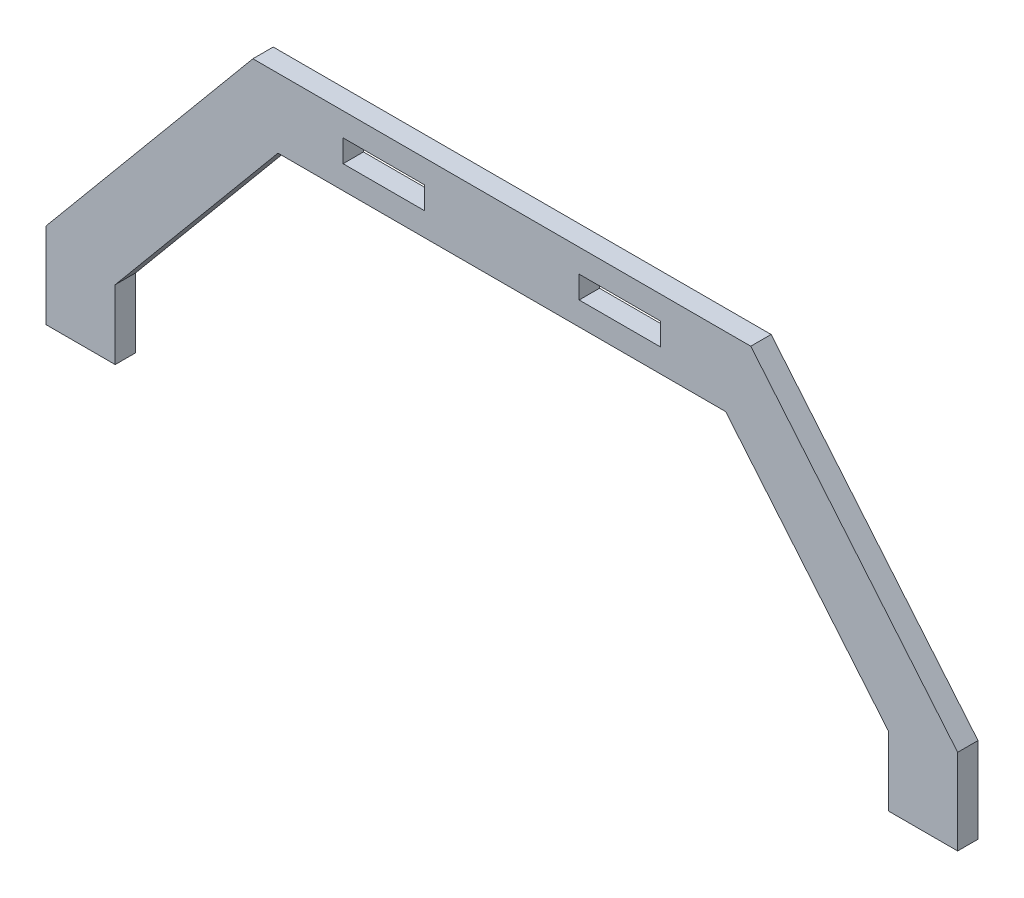
ISO-10303-21;
HEADER;
FILE_DESCRIPTION(('STEP AP214'),'2;1');
FILE_NAME('part.step','',(''),(''),'','','');
FILE_SCHEMA(('AUTOMOTIVE_DESIGN { 1 0 10303 214 1 1 1 1 }'));
ENDSEC;
DATA;
#1=APPLICATION_CONTEXT('core data for automotive mechanical design processes');
#2=APPLICATION_PROTOCOL_DEFINITION('international standard','automotive_design',2000,#1);
#3=PRODUCT_CONTEXT('',#1,'mechanical');
#4=PRODUCT('Part','Part','',(#3));
#5=PRODUCT_RELATED_PRODUCT_CATEGORY('part','',(#4));
#6=PRODUCT_DEFINITION_FORMATION('','',#4);
#7=PRODUCT_DEFINITION_CONTEXT('part definition',#1,'design');
#8=PRODUCT_DEFINITION('design','',#6,#7);
#9=PRODUCT_DEFINITION_SHAPE('','',#8);
#10=(LENGTH_UNIT() NAMED_UNIT(*) SI_UNIT(.MILLI.,.METRE.));
#11=(NAMED_UNIT(*) PLANE_ANGLE_UNIT() SI_UNIT($,.RADIAN.));
#12=(NAMED_UNIT(*) SI_UNIT($,.STERADIAN.) SOLID_ANGLE_UNIT());
#13=UNCERTAINTY_MEASURE_WITH_UNIT(LENGTH_MEASURE(1.E-05),#10,'distance_accuracy_value','');
#14=(GEOMETRIC_REPRESENTATION_CONTEXT(3) GLOBAL_UNCERTAINTY_ASSIGNED_CONTEXT((#13)) GLOBAL_UNIT_ASSIGNED_CONTEXT((#10,
#11,#12)) REPRESENTATION_CONTEXT('',''));
#15=CARTESIAN_POINT('',(0.,0.,0.));
#16=DIRECTION('',(0.,0.,1.));
#17=DIRECTION('',(1.,0.,0.));
#18=AXIS2_PLACEMENT_3D('',#15,#16,#17);
#19=CARTESIAN_POINT('',(0.,0.,5.));
#20=DIRECTION('',(0.,0.,-1.));
#21=DIRECTION('',(-1.,0.,0.));
#22=AXIS2_PLACEMENT_3D('',#19,#20,#21);
#23=PLANE('',#22);
#24=DIRECTION('',(0.,-1.,0.));
#25=VECTOR('',#24,1.);
#26=CARTESIAN_POINT('',(-39.,76.25,5.));
#27=LINE('',#26,#25);
#28=CARTESIAN_POINT('',(-39.,76.25,5.));
#29=VERTEX_POINT('',#28);
#30=CARTESIAN_POINT('',(-39.,70.75,5.));
#31=VERTEX_POINT('',#30);
#32=EDGE_CURVE('E205',#29,#31,#27,.T.);
#33=ORIENTED_EDGE('',*,*,#32,.F.);
#34=DIRECTION('',(-1.,0.,0.));
#35=VECTOR('',#34,1.);
#36=CARTESIAN_POINT('',(-39.,76.25,5.));
#37=LINE('',#36,#35);
#38=CARTESIAN_POINT('',(-19.,76.25,5.));
#39=VERTEX_POINT('',#38);
#40=EDGE_CURVE('E213',#39,#29,#37,.T.);
#41=ORIENTED_EDGE('',*,*,#40,.F.);
#42=DIRECTION('',(0.,1.,0.));
#43=VECTOR('',#42,1.);
#44=CARTESIAN_POINT('',(-19.,76.25,5.));
#45=LINE('',#44,#43);
#46=CARTESIAN_POINT('',(-19.,70.75,5.));
#47=VERTEX_POINT('',#46);
#48=EDGE_CURVE('E210',#47,#39,#45,.T.);
#49=ORIENTED_EDGE('',*,*,#48,.F.);
#50=DIRECTION('',(1.,0.,0.));
#51=VECTOR('',#50,1.);
#52=CARTESIAN_POINT('',(-39.,70.75,5.));
#53=LINE('',#52,#51);
#54=EDGE_CURVE('E207',#31,#47,#53,.T.);
#55=ORIENTED_EDGE('',*,*,#54,.F.);
#56=EDGE_LOOP('',(#33,#41,#49,#55));
#57=FACE_BOUND('',#56,.T.);
#58=DIRECTION('',(0.,-1.,0.));
#59=VECTOR('',#58,1.);
#60=CARTESIAN_POINT('',(-112.,0.,5.));
#61=LINE('',#60,#59);
#62=CARTESIAN_POINT('',(-112.,21.,5.));
#63=VERTEX_POINT('',#62);
#64=CARTESIAN_POINT('',(-112.,0.,5.));
#65=VERTEX_POINT('',#64);
#66=EDGE_CURVE('E236',#63,#65,#61,.T.);
#67=ORIENTED_EDGE('',*,*,#66,.T.);
#68=DIRECTION('',(1.,0.,0.));
#69=VECTOR('',#68,1.);
#70=CARTESIAN_POINT('',(-112.,0.,5.));
#71=LINE('',#70,#69);
#72=CARTESIAN_POINT('',(-95.,0.,5.));
#73=VERTEX_POINT('',#72);
#74=EDGE_CURVE('E239',#65,#73,#71,.T.);
#75=ORIENTED_EDGE('',*,*,#74,.T.);
#76=DIRECTION('',(0.,1.,0.));
#77=VECTOR('',#76,1.);
#78=CARTESIAN_POINT('',(-95.,0.,5.));
#79=LINE('',#78,#77);
#80=CARTESIAN_POINT('',(-95.,17.,5.));
#81=VERTEX_POINT('',#80);
#82=EDGE_CURVE('E242',#73,#81,#79,.T.);
#83=ORIENTED_EDGE('',*,*,#82,.T.);
#84=DIRECTION('',(0.64018439966448,0.768221279597376,0.));
#85=VECTOR('',#84,1.);
#86=CARTESIAN_POINT('',(-95.,17.,5.));
#87=LINE('',#86,#85);
#88=CARTESIAN_POINT('',(-55.,65.,5.));
#89=VERTEX_POINT('',#88);
#90=EDGE_CURVE('E244',#81,#89,#87,.T.);
#91=ORIENTED_EDGE('',*,*,#90,.T.);
#92=DIRECTION('',(1.,0.,0.));
#93=VECTOR('',#92,1.);
#94=CARTESIAN_POINT('',(-55.,65.,5.));
#95=LINE('',#94,#93);
#96=CARTESIAN_POINT('',(55.,65.,5.));
#97=VERTEX_POINT('',#96);
#98=EDGE_CURVE('E246',#89,#97,#95,.T.);
#99=ORIENTED_EDGE('',*,*,#98,.T.);
#100=DIRECTION('',(0.64018439966448,-0.768221279597376,0.));
#101=VECTOR('',#100,1.);
#102=CARTESIAN_POINT('',(95.,17.,5.));
#103=LINE('',#102,#101);
#104=CARTESIAN_POINT('',(95.,17.,5.));
#105=VERTEX_POINT('',#104);
#106=EDGE_CURVE('E248',#97,#105,#103,.T.);
#107=ORIENTED_EDGE('',*,*,#106,.T.);
#108=DIRECTION('',(0.,-1.,0.));
#109=VECTOR('',#108,1.);
#110=CARTESIAN_POINT('',(95.,0.,5.));
#111=LINE('',#110,#109);
#112=CARTESIAN_POINT('',(95.,0.,5.));
#113=VERTEX_POINT('',#112);
#114=EDGE_CURVE('E250',#105,#113,#111,.T.);
#115=ORIENTED_EDGE('',*,*,#114,.T.);
#116=DIRECTION('',(1.,0.,0.));
#117=VECTOR('',#116,1.);
#118=CARTESIAN_POINT('',(112.,0.,5.));
#119=LINE('',#118,#117);
#120=CARTESIAN_POINT('',(112.,0.,5.));
#121=VERTEX_POINT('',#120);
#122=EDGE_CURVE('E252',#113,#121,#119,.T.);
#123=ORIENTED_EDGE('',*,*,#122,.T.);
#124=DIRECTION('',(0.,1.,0.));
#125=VECTOR('',#124,1.);
#126=CARTESIAN_POINT('',(112.,0.,5.));
#127=LINE('',#126,#125);
#128=CARTESIAN_POINT('',(112.,21.,5.));
#129=VERTEX_POINT('',#128);
#130=EDGE_CURVE('E254',#121,#129,#127,.T.);
#131=ORIENTED_EDGE('',*,*,#130,.T.);
#132=DIRECTION('',(-0.64018439966448,0.768221279597376,0.));
#133=VECTOR('',#132,1.);
#134=CARTESIAN_POINT('',(112.,21.,5.));
#135=LINE('',#134,#133);
#136=CARTESIAN_POINT('',(61.1666666666667,82.,5.));
#137=VERTEX_POINT('',#136);
#138=EDGE_CURVE('E256',#129,#137,#135,.T.);
#139=ORIENTED_EDGE('',*,*,#138,.T.);
#140=DIRECTION('',(-1.,0.,0.));
#141=VECTOR('',#140,1.);
#142=CARTESIAN_POINT('',(-61.1666666666667,82.,5.));
#143=LINE('',#142,#141);
#144=CARTESIAN_POINT('',(-61.1666666666667,82.,5.));
#145=VERTEX_POINT('',#144);
#146=EDGE_CURVE('E258',#137,#145,#143,.T.);
#147=ORIENTED_EDGE('',*,*,#146,.T.);
#148=DIRECTION('',(-0.64018439966448,-0.768221279597376,0.));
#149=VECTOR('',#148,1.);
#150=CARTESIAN_POINT('',(-112.,21.,5.));
#151=LINE('',#150,#149);
#152=EDGE_CURVE('E260',#145,#63,#151,.T.);
#153=ORIENTED_EDGE('',*,*,#152,.T.);
#154=EDGE_LOOP('',(#67,#75,#83,#91,#99,#107,#115,#123,#131,#139,#147,#153));
#155=FACE_BOUND('',#154,.T.);
#156=DIRECTION('',(-1.,0.,0.));
#157=VECTOR('',#156,1.);
#158=CARTESIAN_POINT('',(39.,76.25,5.));
#159=LINE('',#158,#157);
#160=CARTESIAN_POINT('',(39.,76.25,5.));
#161=VERTEX_POINT('',#160);
#162=CARTESIAN_POINT('',(19.,76.25,5.));
#163=VERTEX_POINT('',#162);
#164=EDGE_CURVE('E169',#161,#163,#159,.T.);
#165=ORIENTED_EDGE('',*,*,#164,.F.);
#166=DIRECTION('',(0.,1.,0.));
#167=VECTOR('',#166,1.);
#168=CARTESIAN_POINT('',(39.,76.25,5.));
#169=LINE('',#168,#167);
#170=CARTESIAN_POINT('',(39.,70.75,5.));
#171=VERTEX_POINT('',#170);
#172=EDGE_CURVE('E191',#171,#161,#169,.T.);
#173=ORIENTED_EDGE('',*,*,#172,.F.);
#174=DIRECTION('',(1.,0.,0.));
#175=VECTOR('',#174,1.);
#176=CARTESIAN_POINT('',(39.,70.75,5.));
#177=LINE('',#176,#175);
#178=CARTESIAN_POINT('',(19.,70.75,5.));
#179=VERTEX_POINT('',#178);
#180=EDGE_CURVE('E189',#179,#171,#177,.T.);
#181=ORIENTED_EDGE('',*,*,#180,.F.);
#182=DIRECTION('',(0.,-1.,0.));
#183=VECTOR('',#182,1.);
#184=CARTESIAN_POINT('',(19.,76.25,5.));
#185=LINE('',#184,#183);
#186=EDGE_CURVE('E177',#163,#179,#185,.T.);
#187=ORIENTED_EDGE('',*,*,#186,.F.);
#188=EDGE_LOOP('',(#165,#173,#181,#187));
#189=FACE_BOUND('',#188,.T.);
#190=ADVANCED_FACE('F32',(#57,#155,#189),#23,.F.);
#191=CARTESIAN_POINT('',(0.,0.,0.));
#192=DIRECTION('',(0.,0.,-1.));
#193=DIRECTION('',(-1.,0.,0.));
#194=AXIS2_PLACEMENT_3D('',#191,#192,#193);
#195=PLANE('',#194);
#196=DIRECTION('',(0.,-1.,0.));
#197=VECTOR('',#196,1.);
#198=CARTESIAN_POINT('',(-112.,0.,0.));
#199=LINE('',#198,#197);
#200=CARTESIAN_POINT('',(-112.,21.,0.));
#201=VERTEX_POINT('',#200);
#202=CARTESIAN_POINT('',(-112.,0.,0.));
#203=VERTEX_POINT('',#202);
#204=EDGE_CURVE('E235',#201,#203,#199,.T.);
#205=ORIENTED_EDGE('',*,*,#204,.F.);
#206=DIRECTION('',(-0.64018439966448,-0.768221279597376,0.));
#207=VECTOR('',#206,1.);
#208=CARTESIAN_POINT('',(-112.,21.,0.));
#209=LINE('',#208,#207);
#210=CARTESIAN_POINT('',(-61.1666666666667,82.,0.));
#211=VERTEX_POINT('',#210);
#212=EDGE_CURVE('E240',#211,#201,#209,.T.);
#213=ORIENTED_EDGE('',*,*,#212,.F.);
#214=DIRECTION('',(-1.,0.,0.));
#215=VECTOR('',#214,1.);
#216=CARTESIAN_POINT('',(-61.1666666666667,82.,0.));
#217=LINE('',#216,#215);
#218=CARTESIAN_POINT('',(61.1666666666667,82.,0.));
#219=VERTEX_POINT('',#218);
#220=EDGE_CURVE('E283',#219,#211,#217,.T.);
#221=ORIENTED_EDGE('',*,*,#220,.F.);
#222=DIRECTION('',(-0.64018439966448,0.768221279597376,0.));
#223=VECTOR('',#222,1.);
#224=CARTESIAN_POINT('',(112.,21.,0.));
#225=LINE('',#224,#223);
#226=CARTESIAN_POINT('',(112.,21.,0.));
#227=VERTEX_POINT('',#226);
#228=EDGE_CURVE('E281',#227,#219,#225,.T.);
#229=ORIENTED_EDGE('',*,*,#228,.F.);
#230=DIRECTION('',(0.,1.,0.));
#231=VECTOR('',#230,1.);
#232=CARTESIAN_POINT('',(112.,0.,0.));
#233=LINE('',#232,#231);
#234=CARTESIAN_POINT('',(112.,0.,0.));
#235=VERTEX_POINT('',#234);
#236=EDGE_CURVE('E279',#235,#227,#233,.T.);
#237=ORIENTED_EDGE('',*,*,#236,.F.);
#238=DIRECTION('',(1.,0.,0.));
#239=VECTOR('',#238,1.);
#240=CARTESIAN_POINT('',(112.,0.,0.));
#241=LINE('',#240,#239);
#242=CARTESIAN_POINT('',(95.,0.,0.));
#243=VERTEX_POINT('',#242);
#244=EDGE_CURVE('E277',#243,#235,#241,.T.);
#245=ORIENTED_EDGE('',*,*,#244,.F.);
#246=DIRECTION('',(0.,-1.,0.));
#247=VECTOR('',#246,1.);
#248=CARTESIAN_POINT('',(95.,0.,0.));
#249=LINE('',#248,#247);
#250=CARTESIAN_POINT('',(95.,17.,0.));
#251=VERTEX_POINT('',#250);
#252=EDGE_CURVE('E275',#251,#243,#249,.T.);
#253=ORIENTED_EDGE('',*,*,#252,.F.);
#254=DIRECTION('',(0.64018439966448,-0.768221279597376,0.));
#255=VECTOR('',#254,1.);
#256=CARTESIAN_POINT('',(95.,17.,0.));
#257=LINE('',#256,#255);
#258=CARTESIAN_POINT('',(55.,65.,0.));
#259=VERTEX_POINT('',#258);
#260=EDGE_CURVE('E273',#259,#251,#257,.T.);
#261=ORIENTED_EDGE('',*,*,#260,.F.);
#262=DIRECTION('',(1.,0.,0.));
#263=VECTOR('',#262,1.);
#264=CARTESIAN_POINT('',(-55.,65.,0.));
#265=LINE('',#264,#263);
#266=CARTESIAN_POINT('',(-55.,65.,0.));
#267=VERTEX_POINT('',#266);
#268=EDGE_CURVE('E271',#267,#259,#265,.T.);
#269=ORIENTED_EDGE('',*,*,#268,.F.);
#270=DIRECTION('',(0.64018439966448,0.768221279597376,0.));
#271=VECTOR('',#270,1.);
#272=CARTESIAN_POINT('',(-95.,17.,0.));
#273=LINE('',#272,#271);
#274=CARTESIAN_POINT('',(-95.,17.,0.));
#275=VERTEX_POINT('',#274);
#276=EDGE_CURVE('E269',#275,#267,#273,.T.);
#277=ORIENTED_EDGE('',*,*,#276,.F.);
#278=DIRECTION('',(0.,1.,0.));
#279=VECTOR('',#278,1.);
#280=CARTESIAN_POINT('',(-95.,0.,0.));
#281=LINE('',#280,#279);
#282=CARTESIAN_POINT('',(-95.,0.,0.));
#283=VERTEX_POINT('',#282);
#284=EDGE_CURVE('E267',#283,#275,#281,.T.);
#285=ORIENTED_EDGE('',*,*,#284,.F.);
#286=DIRECTION('',(1.,0.,0.));
#287=VECTOR('',#286,1.);
#288=CARTESIAN_POINT('',(-112.,0.,0.));
#289=LINE('',#288,#287);
#290=EDGE_CURVE('E265',#203,#283,#289,.T.);
#291=ORIENTED_EDGE('',*,*,#290,.F.);
#292=EDGE_LOOP('',(#205,#213,#221,#229,#237,#245,#253,#261,#269,#277,#285,#291));
#293=FACE_BOUND('',#292,.T.);
#294=DIRECTION('',(-1.,0.,0.));
#295=VECTOR('',#294,1.);
#296=CARTESIAN_POINT('',(-39.,76.25,0.));
#297=LINE('',#296,#295);
#298=CARTESIAN_POINT('',(-19.,76.25,0.));
#299=VERTEX_POINT('',#298);
#300=CARTESIAN_POINT('',(-39.,76.25,0.));
#301=VERTEX_POINT('',#300);
#302=EDGE_CURVE('E208',#299,#301,#297,.T.);
#303=ORIENTED_EDGE('',*,*,#302,.T.);
#304=DIRECTION('',(0.,-1.,0.));
#305=VECTOR('',#304,1.);
#306=CARTESIAN_POINT('',(-39.,76.25,0.));
#307=LINE('',#306,#305);
#308=CARTESIAN_POINT('',(-39.,70.75,0.));
#309=VERTEX_POINT('',#308);
#310=EDGE_CURVE('E185',#301,#309,#307,.T.);
#311=ORIENTED_EDGE('',*,*,#310,.T.);
#312=DIRECTION('',(1.,0.,0.));
#313=VECTOR('',#312,1.);
#314=CARTESIAN_POINT('',(-39.,70.75,0.));
#315=LINE('',#314,#313);
#316=CARTESIAN_POINT('',(-19.,70.75,0.));
#317=VERTEX_POINT('',#316);
#318=EDGE_CURVE('E218',#309,#317,#315,.T.);
#319=ORIENTED_EDGE('',*,*,#318,.T.);
#320=DIRECTION('',(0.,1.,0.));
#321=VECTOR('',#320,1.);
#322=CARTESIAN_POINT('',(-19.,76.25,0.));
#323=LINE('',#322,#321);
#324=EDGE_CURVE('E221',#317,#299,#323,.T.);
#325=ORIENTED_EDGE('',*,*,#324,.T.);
#326=EDGE_LOOP('',(#303,#311,#319,#325));
#327=FACE_BOUND('',#326,.T.);
#328=DIRECTION('',(0.,1.,0.));
#329=VECTOR('',#328,1.);
#330=CARTESIAN_POINT('',(39.,76.25,0.));
#331=LINE('',#330,#329);
#332=CARTESIAN_POINT('',(39.,70.75,0.));
#333=VERTEX_POINT('',#332);
#334=CARTESIAN_POINT('',(39.,76.25,0.));
#335=VERTEX_POINT('',#334);
#336=EDGE_CURVE('E178',#333,#335,#331,.T.);
#337=ORIENTED_EDGE('',*,*,#336,.T.);
#338=DIRECTION('',(-1.,0.,0.));
#339=VECTOR('',#338,1.);
#340=CARTESIAN_POINT('',(39.,76.25,0.));
#341=LINE('',#340,#339);
#342=CARTESIAN_POINT('',(19.,76.25,0.));
#343=VERTEX_POINT('',#342);
#344=EDGE_CURVE('E55',#335,#343,#341,.T.);
#345=ORIENTED_EDGE('',*,*,#344,.T.);
#346=DIRECTION('',(0.,-1.,0.));
#347=VECTOR('',#346,1.);
#348=CARTESIAN_POINT('',(19.,76.25,0.));
#349=LINE('',#348,#347);
#350=CARTESIAN_POINT('',(19.,70.75,0.));
#351=VERTEX_POINT('',#350);
#352=EDGE_CURVE('E184',#343,#351,#349,.T.);
#353=ORIENTED_EDGE('',*,*,#352,.T.);
#354=DIRECTION('',(1.,0.,0.));
#355=VECTOR('',#354,1.);
#356=CARTESIAN_POINT('',(39.,70.75,0.));
#357=LINE('',#356,#355);
#358=EDGE_CURVE('E197',#351,#333,#357,.T.);
#359=ORIENTED_EDGE('',*,*,#358,.T.);
#360=EDGE_LOOP('',(#337,#345,#353,#359));
#361=FACE_BOUND('',#360,.T.);
#362=ADVANCED_FACE('F325',(#293,#327,#361),#195,.T.);
#363=CARTESIAN_POINT('',(-112.,0.,5.));
#364=DIRECTION('',(1.,0.,0.));
#365=DIRECTION('',(0.,0.,-1.));
#366=AXIS2_PLACEMENT_3D('',#363,#364,#365);
#367=PLANE('',#366);
#368=ORIENTED_EDGE('',*,*,#204,.T.);
#369=DIRECTION('',(0.,0.,-1.));
#370=VECTOR('',#369,1.);
#371=CARTESIAN_POINT('',(-112.,0.,5.));
#372=LINE('',#371,#370);
#373=EDGE_CURVE('E11',#65,#203,#372,.T.);
#374=ORIENTED_EDGE('',*,*,#373,.F.);
#375=ORIENTED_EDGE('',*,*,#66,.F.);
#376=DIRECTION('',(0.,0.,-1.));
#377=VECTOR('',#376,1.);
#378=CARTESIAN_POINT('',(-112.,21.,5.));
#379=LINE('',#378,#377);
#380=EDGE_CURVE('E262',#63,#201,#379,.T.);
#381=ORIENTED_EDGE('',*,*,#380,.T.);
#382=EDGE_LOOP('',(#368,#374,#375,#381));
#383=FACE_BOUND('',#382,.T.);
#384=ADVANCED_FACE('F34',(#383),#367,.F.);
#385=CARTESIAN_POINT('',(-112.,0.,5.));
#386=DIRECTION('',(0.,1.,0.));
#387=DIRECTION('',(0.,0.,1.));
#388=AXIS2_PLACEMENT_3D('',#385,#386,#387);
#389=PLANE('',#388);
#390=ORIENTED_EDGE('',*,*,#290,.T.);
#391=DIRECTION('',(0.,0.,-1.));
#392=VECTOR('',#391,1.);
#393=CARTESIAN_POINT('',(-95.,0.,5.));
#394=LINE('',#393,#392);
#395=EDGE_CURVE('E40',#73,#283,#394,.T.);
#396=ORIENTED_EDGE('',*,*,#395,.F.);
#397=ORIENTED_EDGE('',*,*,#74,.F.);
#398=ORIENTED_EDGE('',*,*,#373,.T.);
#399=EDGE_LOOP('',(#390,#396,#397,#398));
#400=FACE_BOUND('',#399,.T.);
#401=ADVANCED_FACE('F342',(#400),#389,.F.);
#402=CARTESIAN_POINT('',(-95.,0.,5.));
#403=DIRECTION('',(-1.,0.,0.));
#404=DIRECTION('',(0.,0.,1.));
#405=AXIS2_PLACEMENT_3D('',#402,#403,#404);
#406=PLANE('',#405);
#407=ORIENTED_EDGE('',*,*,#284,.T.);
#408=DIRECTION('',(0.,0.,-1.));
#409=VECTOR('',#408,1.);
#410=CARTESIAN_POINT('',(-95.,17.,5.));
#411=LINE('',#410,#409);
#412=EDGE_CURVE('E312',#81,#275,#411,.T.);
#413=ORIENTED_EDGE('',*,*,#412,.F.);
#414=ORIENTED_EDGE('',*,*,#82,.F.);
#415=ORIENTED_EDGE('',*,*,#395,.T.);
#416=EDGE_LOOP('',(#407,#413,#414,#415));
#417=FACE_BOUND('',#416,.T.);
#418=ADVANCED_FACE('F319',(#417),#406,.F.);
#419=CARTESIAN_POINT('',(-95.,17.,5.));
#420=DIRECTION('',(-0.768221279597376,0.64018439966448,0.));
#421=DIRECTION('',(-0.64018439966448,-0.768221279597376,0.));
#422=AXIS2_PLACEMENT_3D('',#419,#420,#421);
#423=PLANE('',#422);
#424=ORIENTED_EDGE('',*,*,#276,.T.);
#425=DIRECTION('',(0.,0.,-1.));
#426=VECTOR('',#425,1.);
#427=CARTESIAN_POINT('',(-55.,65.,5.));
#428=LINE('',#427,#426);
#429=EDGE_CURVE('E309',#89,#267,#428,.T.);
#430=ORIENTED_EDGE('',*,*,#429,.F.);
#431=ORIENTED_EDGE('',*,*,#90,.F.);
#432=ORIENTED_EDGE('',*,*,#412,.T.);
#433=EDGE_LOOP('',(#424,#430,#431,#432));
#434=FACE_BOUND('',#433,.T.);
#435=ADVANCED_FACE('F331',(#434),#423,.F.);
#436=CARTESIAN_POINT('',(-55.,65.,5.));
#437=DIRECTION('',(0.,1.,0.));
#438=DIRECTION('',(0.,0.,1.));
#439=AXIS2_PLACEMENT_3D('',#436,#437,#438);
#440=PLANE('',#439);
#441=ORIENTED_EDGE('',*,*,#268,.T.);
#442=DIRECTION('',(0.,0.,-1.));
#443=VECTOR('',#442,1.);
#444=CARTESIAN_POINT('',(55.,65.,5.));
#445=LINE('',#444,#443);
#446=EDGE_CURVE('E306',#97,#259,#445,.T.);
#447=ORIENTED_EDGE('',*,*,#446,.F.);
#448=ORIENTED_EDGE('',*,*,#98,.F.);
#449=ORIENTED_EDGE('',*,*,#429,.T.);
#450=EDGE_LOOP('',(#441,#447,#448,#449));
#451=FACE_BOUND('',#450,.T.);
#452=ADVANCED_FACE('F335',(#451),#440,.F.);
#453=CARTESIAN_POINT('',(95.,17.,5.));
#454=DIRECTION('',(0.768221279597376,0.64018439966448,0.));
#455=DIRECTION('',(-0.64018439966448,0.768221279597376,0.));
#456=AXIS2_PLACEMENT_3D('',#453,#454,#455);
#457=PLANE('',#456);
#458=ORIENTED_EDGE('',*,*,#260,.T.);
#459=DIRECTION('',(0.,0.,-1.));
#460=VECTOR('',#459,1.);
#461=CARTESIAN_POINT('',(95.,17.,5.));
#462=LINE('',#461,#460);
#463=EDGE_CURVE('E303',#105,#251,#462,.T.);
#464=ORIENTED_EDGE('',*,*,#463,.F.);
#465=ORIENTED_EDGE('',*,*,#106,.F.);
#466=ORIENTED_EDGE('',*,*,#446,.T.);
#467=EDGE_LOOP('',(#458,#464,#465,#466));
#468=FACE_BOUND('',#467,.T.);
#469=ADVANCED_FACE('F375',(#468),#457,.F.);
#470=CARTESIAN_POINT('',(95.,0.,5.));
#471=DIRECTION('',(1.,0.,0.));
#472=DIRECTION('',(0.,0.,-1.));
#473=AXIS2_PLACEMENT_3D('',#470,#471,#472);
#474=PLANE('',#473);
#475=ORIENTED_EDGE('',*,*,#252,.T.);
#476=DIRECTION('',(0.,0.,-1.));
#477=VECTOR('',#476,1.);
#478=CARTESIAN_POINT('',(95.,0.,5.));
#479=LINE('',#478,#477);
#480=EDGE_CURVE('E300',#113,#243,#479,.T.);
#481=ORIENTED_EDGE('',*,*,#480,.F.);
#482=ORIENTED_EDGE('',*,*,#114,.F.);
#483=ORIENTED_EDGE('',*,*,#463,.T.);
#484=EDGE_LOOP('',(#475,#481,#482,#483));
#485=FACE_BOUND('',#484,.T.);
#486=ADVANCED_FACE('F373',(#485),#474,.F.);
#487=CARTESIAN_POINT('',(112.,0.,5.));
#488=DIRECTION('',(0.,1.,0.));
#489=DIRECTION('',(0.,0.,1.));
#490=AXIS2_PLACEMENT_3D('',#487,#488,#489);
#491=PLANE('',#490);
#492=ORIENTED_EDGE('',*,*,#244,.T.);
#493=DIRECTION('',(0.,0.,-1.));
#494=VECTOR('',#493,1.);
#495=CARTESIAN_POINT('',(112.,0.,5.));
#496=LINE('',#495,#494);
#497=EDGE_CURVE('E297',#121,#235,#496,.T.);
#498=ORIENTED_EDGE('',*,*,#497,.F.);
#499=ORIENTED_EDGE('',*,*,#122,.F.);
#500=ORIENTED_EDGE('',*,*,#480,.T.);
#501=EDGE_LOOP('',(#492,#498,#499,#500));
#502=FACE_BOUND('',#501,.T.);
#503=ADVANCED_FACE('F369',(#502),#491,.F.);
#504=CARTESIAN_POINT('',(112.,0.,5.));
#505=DIRECTION('',(-1.,0.,0.));
#506=DIRECTION('',(0.,0.,1.));
#507=AXIS2_PLACEMENT_3D('',#504,#505,#506);
#508=PLANE('',#507);
#509=ORIENTED_EDGE('',*,*,#236,.T.);
#510=DIRECTION('',(0.,0.,-1.));
#511=VECTOR('',#510,1.);
#512=CARTESIAN_POINT('',(112.,21.,5.));
#513=LINE('',#512,#511);
#514=EDGE_CURVE('E294',#129,#227,#513,.T.);
#515=ORIENTED_EDGE('',*,*,#514,.F.);
#516=ORIENTED_EDGE('',*,*,#130,.F.);
#517=ORIENTED_EDGE('',*,*,#497,.T.);
#518=EDGE_LOOP('',(#509,#515,#516,#517));
#519=FACE_BOUND('',#518,.T.);
#520=ADVANCED_FACE('F364',(#519),#508,.F.);
#521=CARTESIAN_POINT('',(112.,21.,5.));
#522=DIRECTION('',(-0.768221279597376,-0.64018439966448,0.));
#523=DIRECTION('',(0.64018439966448,-0.768221279597376,0.));
#524=AXIS2_PLACEMENT_3D('',#521,#522,#523);
#525=PLANE('',#524);
#526=ORIENTED_EDGE('',*,*,#228,.T.);
#527=DIRECTION('',(0.,0.,-1.));
#528=VECTOR('',#527,1.);
#529=CARTESIAN_POINT('',(61.1666666666667,82.,5.));
#530=LINE('',#529,#528);
#531=EDGE_CURVE('E291',#137,#219,#530,.T.);
#532=ORIENTED_EDGE('',*,*,#531,.F.);
#533=ORIENTED_EDGE('',*,*,#138,.F.);
#534=ORIENTED_EDGE('',*,*,#514,.T.);
#535=EDGE_LOOP('',(#526,#532,#533,#534));
#536=FACE_BOUND('',#535,.T.);
#537=ADVANCED_FACE('F358',(#536),#525,.F.);
#538=CARTESIAN_POINT('',(-61.1666666666667,82.,5.));
#539=DIRECTION('',(0.,-1.,0.));
#540=DIRECTION('',(0.,0.,-1.));
#541=AXIS2_PLACEMENT_3D('',#538,#539,#540);
#542=PLANE('',#541);
#543=ORIENTED_EDGE('',*,*,#220,.T.);
#544=DIRECTION('',(0.,0.,-1.));
#545=VECTOR('',#544,1.);
#546=CARTESIAN_POINT('',(-61.1666666666667,82.,5.));
#547=LINE('',#546,#545);
#548=EDGE_CURVE('E288',#145,#211,#547,.T.);
#549=ORIENTED_EDGE('',*,*,#548,.F.);
#550=ORIENTED_EDGE('',*,*,#146,.F.);
#551=ORIENTED_EDGE('',*,*,#531,.T.);
#552=EDGE_LOOP('',(#543,#549,#550,#551));
#553=FACE_BOUND('',#552,.T.);
#554=ADVANCED_FACE('F354',(#553),#542,.F.);
#555=CARTESIAN_POINT('',(-112.,21.,5.));
#556=DIRECTION('',(0.768221279597376,-0.64018439966448,0.));
#557=DIRECTION('',(0.64018439966448,0.768221279597376,0.));
#558=AXIS2_PLACEMENT_3D('',#555,#556,#557);
#559=PLANE('',#558);
#560=ORIENTED_EDGE('',*,*,#212,.T.);
#561=ORIENTED_EDGE('',*,*,#380,.F.);
#562=ORIENTED_EDGE('',*,*,#152,.F.);
#563=ORIENTED_EDGE('',*,*,#548,.T.);
#564=EDGE_LOOP('',(#560,#561,#562,#563));
#565=FACE_BOUND('',#564,.T.);
#566=ADVANCED_FACE('F349',(#565),#559,.F.);
#567=CARTESIAN_POINT('',(-39.,76.25,5.));
#568=DIRECTION('',(1.,0.,0.));
#569=DIRECTION('',(0.,0.,-1.));
#570=AXIS2_PLACEMENT_3D('',#567,#568,#569);
#571=PLANE('',#570);
#572=ORIENTED_EDGE('',*,*,#310,.F.);
#573=DIRECTION('',(0.,0.,-1.));
#574=VECTOR('',#573,1.);
#575=CARTESIAN_POINT('',(-39.,76.25,5.));
#576=LINE('',#575,#574);
#577=EDGE_CURVE('E215',#29,#301,#576,.T.);
#578=ORIENTED_EDGE('',*,*,#577,.F.);
#579=ORIENTED_EDGE('',*,*,#32,.T.);
#580=DIRECTION('',(0.,0.,-1.));
#581=VECTOR('',#580,1.);
#582=CARTESIAN_POINT('',(-39.,70.75,5.));
#583=LINE('',#582,#581);
#584=EDGE_CURVE('E232',#31,#309,#583,.T.);
#585=ORIENTED_EDGE('',*,*,#584,.T.);
#586=EDGE_LOOP('',(#572,#578,#579,#585));
#587=FACE_BOUND('',#586,.T.);
#588=ADVANCED_FACE('F393',(#587),#571,.T.);
#589=CARTESIAN_POINT('',(-39.,70.75,5.));
#590=DIRECTION('',(0.,1.,0.));
#591=DIRECTION('',(0.,0.,1.));
#592=AXIS2_PLACEMENT_3D('',#589,#590,#591);
#593=PLANE('',#592);
#594=ORIENTED_EDGE('',*,*,#318,.F.);
#595=ORIENTED_EDGE('',*,*,#584,.F.);
#596=ORIENTED_EDGE('',*,*,#54,.T.);
#597=DIRECTION('',(0.,0.,-1.));
#598=VECTOR('',#597,1.);
#599=CARTESIAN_POINT('',(-19.,70.75,5.));
#600=LINE('',#599,#598);
#601=EDGE_CURVE('E230',#47,#317,#600,.T.);
#602=ORIENTED_EDGE('',*,*,#601,.T.);
#603=EDGE_LOOP('',(#594,#595,#596,#602));
#604=FACE_BOUND('',#603,.T.);
#605=ADVANCED_FACE('F431',(#604),#593,.T.);
#606=CARTESIAN_POINT('',(-19.,76.25,5.));
#607=DIRECTION('',(-1.,0.,0.));
#608=DIRECTION('',(0.,-1.,0.));
#609=AXIS2_PLACEMENT_3D('',#606,#607,#608);
#610=PLANE('',#609);
#611=ORIENTED_EDGE('',*,*,#324,.F.);
#612=ORIENTED_EDGE('',*,*,#601,.F.);
#613=ORIENTED_EDGE('',*,*,#48,.T.);
#614=DIRECTION('',(0.,0.,-1.));
#615=VECTOR('',#614,1.);
#616=CARTESIAN_POINT('',(-19.,76.25,5.));
#617=LINE('',#616,#615);
#618=EDGE_CURVE('E228',#39,#299,#617,.T.);
#619=ORIENTED_EDGE('',*,*,#618,.T.);
#620=EDGE_LOOP('',(#611,#612,#613,#619));
#621=FACE_BOUND('',#620,.T.);
#622=ADVANCED_FACE('F438',(#621),#610,.T.);
#623=CARTESIAN_POINT('',(-39.,76.25,5.));
#624=DIRECTION('',(0.,-1.,0.));
#625=DIRECTION('',(0.,0.,-1.));
#626=AXIS2_PLACEMENT_3D('',#623,#624,#625);
#627=PLANE('',#626);
#628=ORIENTED_EDGE('',*,*,#302,.F.);
#629=ORIENTED_EDGE('',*,*,#618,.F.);
#630=ORIENTED_EDGE('',*,*,#40,.T.);
#631=ORIENTED_EDGE('',*,*,#577,.T.);
#632=EDGE_LOOP('',(#628,#629,#630,#631));
#633=FACE_BOUND('',#632,.T.);
#634=ADVANCED_FACE('F445',(#633),#627,.T.);
#635=CARTESIAN_POINT('',(39.,76.25,5.));
#636=DIRECTION('',(0.,-1.,0.));
#637=DIRECTION('',(0.,0.,-1.));
#638=AXIS2_PLACEMENT_3D('',#635,#636,#637);
#639=PLANE('',#638);
#640=ORIENTED_EDGE('',*,*,#344,.F.);
#641=DIRECTION('',(0.,0.,-1.));
#642=VECTOR('',#641,1.);
#643=CARTESIAN_POINT('',(39.,76.25,5.));
#644=LINE('',#643,#642);
#645=EDGE_CURVE('E173',#161,#335,#644,.T.);
#646=ORIENTED_EDGE('',*,*,#645,.F.);
#647=ORIENTED_EDGE('',*,*,#164,.T.);
#648=DIRECTION('',(0.,0.,-1.));
#649=VECTOR('',#648,1.);
#650=CARTESIAN_POINT('',(19.,76.25,5.));
#651=LINE('',#650,#649);
#652=EDGE_CURVE('E172',#163,#343,#651,.T.);
#653=ORIENTED_EDGE('',*,*,#652,.T.);
#654=EDGE_LOOP('',(#640,#646,#647,#653));
#655=FACE_BOUND('',#654,.T.);
#656=ADVANCED_FACE('F171',(#655),#639,.T.);
#657=CARTESIAN_POINT('',(19.,76.25,5.));
#658=DIRECTION('',(1.,0.,0.));
#659=DIRECTION('',(0.,1.,0.));
#660=AXIS2_PLACEMENT_3D('',#657,#658,#659);
#661=PLANE('',#660);
#662=ORIENTED_EDGE('',*,*,#352,.F.);
#663=ORIENTED_EDGE('',*,*,#652,.F.);
#664=ORIENTED_EDGE('',*,*,#186,.T.);
#665=DIRECTION('',(0.,0.,-1.));
#666=VECTOR('',#665,1.);
#667=CARTESIAN_POINT('',(19.,70.75,5.));
#668=LINE('',#667,#666);
#669=EDGE_CURVE('E186',#179,#351,#668,.T.);
#670=ORIENTED_EDGE('',*,*,#669,.T.);
#671=EDGE_LOOP('',(#662,#663,#664,#670));
#672=FACE_BOUND('',#671,.T.);
#673=ADVANCED_FACE('F181',(#672),#661,.T.);
#674=CARTESIAN_POINT('',(39.,70.75,5.));
#675=DIRECTION('',(0.,1.,0.));
#676=DIRECTION('',(0.,0.,1.));
#677=AXIS2_PLACEMENT_3D('',#674,#675,#676);
#678=PLANE('',#677);
#679=ORIENTED_EDGE('',*,*,#358,.F.);
#680=ORIENTED_EDGE('',*,*,#669,.F.);
#681=ORIENTED_EDGE('',*,*,#180,.T.);
#682=DIRECTION('',(0.,0.,-1.));
#683=VECTOR('',#682,1.);
#684=CARTESIAN_POINT('',(39.,70.75,5.));
#685=LINE('',#684,#683);
#686=EDGE_CURVE('E47',#171,#333,#685,.T.);
#687=ORIENTED_EDGE('',*,*,#686,.T.);
#688=EDGE_LOOP('',(#679,#680,#681,#687));
#689=FACE_BOUND('',#688,.T.);
#690=ADVANCED_FACE('F466',(#689),#678,.T.);
#691=CARTESIAN_POINT('',(39.,76.25,5.));
#692=DIRECTION('',(-1.,0.,0.));
#693=DIRECTION('',(0.,0.,1.));
#694=AXIS2_PLACEMENT_3D('',#691,#692,#693);
#695=PLANE('',#694);
#696=ORIENTED_EDGE('',*,*,#336,.F.);
#697=ORIENTED_EDGE('',*,*,#686,.F.);
#698=ORIENTED_EDGE('',*,*,#172,.T.);
#699=ORIENTED_EDGE('',*,*,#645,.T.);
#700=EDGE_LOOP('',(#696,#697,#698,#699));
#701=FACE_BOUND('',#700,.T.);
#702=ADVANCED_FACE('F473',(#701),#695,.T.);
#703=CLOSED_SHELL('',(#190,#362,#384,#401,#418,#435,#452,#469,#486,#503,#520,#537,#554,#566,
#588,#605,#622,#634,#656,#673,#690,#702));
#704=MANIFOLD_SOLID_BREP('B2',#703);
#705=ADVANCED_BREP_SHAPE_REPRESENTATION('',(#18,#704),#14);
#706=SHAPE_DEFINITION_REPRESENTATION(#9,#705);
ENDSEC;
END-ISO-10303-21;
